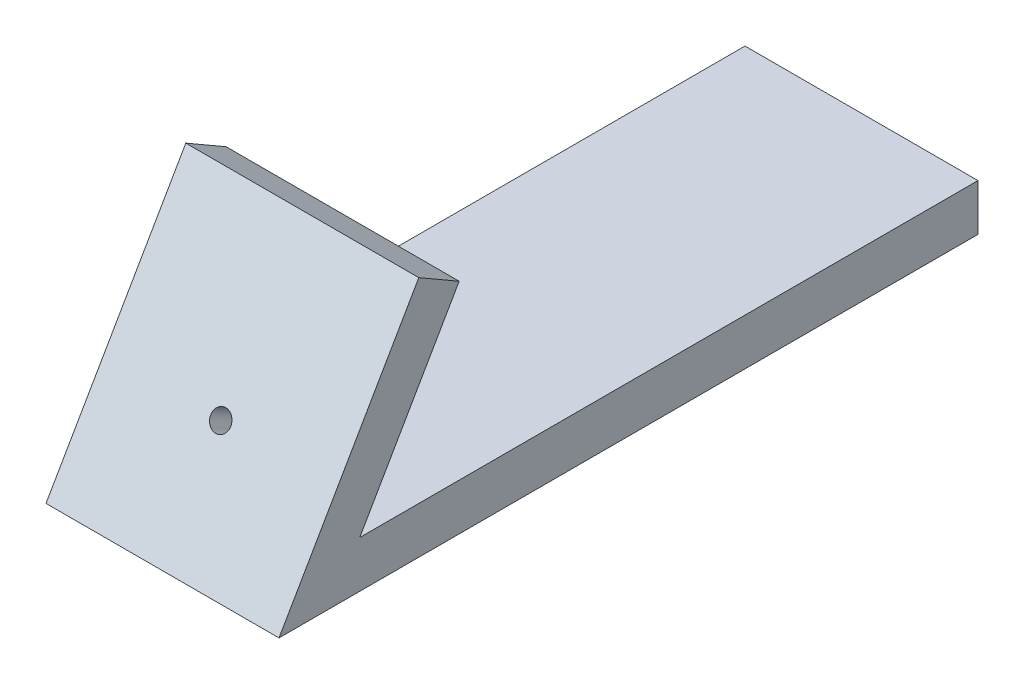
ISO-10303-21;
HEADER;
FILE_DESCRIPTION(('STEP AP214'),'2;1');
FILE_NAME('part.step','',(''),(''),'','','');
FILE_SCHEMA(('AUTOMOTIVE_DESIGN { 1 0 10303 214 1 1 1 1 }'));
ENDSEC;
DATA;
#1=APPLICATION_CONTEXT('core data for automotive mechanical design processes');
#2=APPLICATION_PROTOCOL_DEFINITION('international standard','automotive_design',2000,#1);
#3=PRODUCT_CONTEXT('',#1,'mechanical');
#4=PRODUCT('Part','Part','',(#3));
#5=PRODUCT_RELATED_PRODUCT_CATEGORY('part','',(#4));
#6=PRODUCT_DEFINITION_FORMATION('','',#4);
#7=PRODUCT_DEFINITION_CONTEXT('part definition',#1,'design');
#8=PRODUCT_DEFINITION('design','',#6,#7);
#9=PRODUCT_DEFINITION_SHAPE('','',#8);
#10=(LENGTH_UNIT() NAMED_UNIT(*) SI_UNIT(.MILLI.,.METRE.));
#11=(NAMED_UNIT(*) PLANE_ANGLE_UNIT() SI_UNIT($,.RADIAN.));
#12=(NAMED_UNIT(*) SI_UNIT($,.STERADIAN.) SOLID_ANGLE_UNIT());
#13=UNCERTAINTY_MEASURE_WITH_UNIT(LENGTH_MEASURE(1.E-05),#10,'distance_accuracy_value','');
#14=(GEOMETRIC_REPRESENTATION_CONTEXT(3) GLOBAL_UNCERTAINTY_ASSIGNED_CONTEXT((#13)) GLOBAL_UNIT_ASSIGNED_CONTEXT((#10,
#11,#12)) REPRESENTATION_CONTEXT('',''));
#15=CARTESIAN_POINT('',(0.,0.,0.));
#16=DIRECTION('',(0.,0.,1.));
#17=DIRECTION('',(1.,0.,0.));
#18=AXIS2_PLACEMENT_3D('',#15,#16,#17);
#19=CARTESIAN_POINT('',(50.,-1.952846430748,14.9831676560337));
#20=DIRECTION('',(0.,-1.,0.));
#21=DIRECTION('',(0.,0.,-1.));
#22=AXIS2_PLACEMENT_3D('',#19,#20,#21);
#23=PLANE('',#22);
#24=DIRECTION('',(0.,0.,1.));
#25=VECTOR('',#24,1.);
#26=CARTESIAN_POINT('',(0.,-1.952846430748,14.9831676560337));
#27=LINE('',#26,#25);
#28=CARTESIAN_POINT('',(0.,-1.952846430748,-117.696324268277));
#29=VERTEX_POINT('',#28);
#30=CARTESIAN_POINT('',(0.,-1.952846430748,14.9831676560337));
#31=VERTEX_POINT('',#30);
#32=EDGE_CURVE('E128',#29,#31,#27,.T.);
#33=ORIENTED_EDGE('',*,*,#32,.T.);
#34=DIRECTION('',(-1.,0.,0.));
#35=VECTOR('',#34,1.);
#36=CARTESIAN_POINT('',(50.,-1.952846430748,14.9831676560337));
#37=LINE('',#36,#35);
#38=CARTESIAN_POINT('',(50.,-1.952846430748,14.9831676560337));
#39=VERTEX_POINT('',#38);
#40=EDGE_CURVE('E11',#39,#31,#37,.T.);
#41=ORIENTED_EDGE('',*,*,#40,.F.);
#42=DIRECTION('',(0.,0.,1.));
#43=VECTOR('',#42,1.);
#44=CARTESIAN_POINT('',(50.,-1.952846430748,14.9831676560337));
#45=LINE('',#44,#43);
#46=CARTESIAN_POINT('',(50.,-1.952846430748,-117.696324268277));
#47=VERTEX_POINT('',#46);
#48=EDGE_CURVE('E145',#47,#39,#45,.T.);
#49=ORIENTED_EDGE('',*,*,#48,.F.);
#50=DIRECTION('',(-1.,0.,0.));
#51=VECTOR('',#50,1.);
#52=CARTESIAN_POINT('',(50.,-1.952846430748,-117.696324268277));
#53=LINE('',#52,#51);
#54=EDGE_CURVE('E124',#47,#29,#53,.T.);
#55=ORIENTED_EDGE('',*,*,#54,.T.);
#56=EDGE_LOOP('',(#33,#41,#49,#55));
#57=FACE_BOUND('',#56,.T.);
#58=ADVANCED_FACE('F39',(#57),#23,.F.);
#59=CARTESIAN_POINT('',(50.,35.0086777963181,-6.356578306122));
#60=DIRECTION('',(0.,0.500000000000004,0.866025403784436));
#61=DIRECTION('',(0.,-0.866025403784436,0.500000000000004));
#62=AXIS2_PLACEMENT_3D('',#59,#60,#61);
#63=PLANE('',#62);
#64=CARTESIAN_POINT('',(25.,4.69778866386285,11.1434216938781));
#65=DIRECTION('',(0.,0.500000000000004,0.866025403784436));
#66=DIRECTION('',(0.,-0.866025403784436,0.500000000000004));
#67=AXIS2_PLACEMENT_3D('',#64,#65,#66);
#68=CIRCLE('',#67,2.15);
#69=CARTESIAN_POINT('',(25.,2.83583404572632,12.2184216938782));
#70=VERTEX_POINT('',#69);
#71=EDGE_CURVE('E133',#70,#70,#68,.T.);
#72=ORIENTED_EDGE('',*,*,#71,.T.);
#73=EDGE_LOOP('',(#72));
#74=FACE_BOUND('',#73,.T.);
#75=DIRECTION('',(0.,0.866025403784436,-0.500000000000004));
#76=VECTOR('',#75,1.);
#77=CARTESIAN_POINT('',(0.,35.0086777963181,-6.356578306122));
#78=LINE('',#77,#76);
#79=CARTESIAN_POINT('',(0.,35.0086777963181,-6.356578306122));
#80=VERTEX_POINT('',#79);
#81=EDGE_CURVE('E132',#31,#80,#78,.T.);
#82=ORIENTED_EDGE('',*,*,#81,.T.);
#83=DIRECTION('',(-1.,0.,0.));
#84=VECTOR('',#83,1.);
#85=CARTESIAN_POINT('',(50.,35.0086777963181,-6.356578306122));
#86=LINE('',#85,#84);
#87=CARTESIAN_POINT('',(50.,35.0086777963181,-6.356578306122));
#88=VERTEX_POINT('',#87);
#89=EDGE_CURVE('E48',#88,#80,#86,.T.);
#90=ORIENTED_EDGE('',*,*,#89,.F.);
#91=DIRECTION('',(0.,0.866025403784436,-0.500000000000004));
#92=VECTOR('',#91,1.);
#93=CARTESIAN_POINT('',(50.,35.0086777963181,-6.356578306122));
#94=LINE('',#93,#92);
#95=EDGE_CURVE('E93',#39,#88,#94,.T.);
#96=ORIENTED_EDGE('',*,*,#95,.F.);
#97=ORIENTED_EDGE('',*,*,#40,.T.);
#98=EDGE_LOOP('',(#82,#90,#96,#97));
#99=FACE_BOUND('',#98,.T.);
#100=ADVANCED_FACE('F173',(#74,#99),#63,.F.);
#101=CARTESIAN_POINT('',(50.,40.0086777963182,2.30367573172237));
#102=DIRECTION('',(0.,-0.866025403784437,0.500000000000003));
#103=DIRECTION('',(0.,-0.500000000000003,-0.866025403784437));
#104=AXIS2_PLACEMENT_3D('',#101,#102,#103);
#105=PLANE('',#104);
#106=DIRECTION('',(0.,0.500000000000003,0.866025403784437));
#107=VECTOR('',#106,1.);
#108=CARTESIAN_POINT('',(0.,40.0086777963182,2.30367573172237));
#109=LINE('',#108,#107);
#110=CARTESIAN_POINT('',(0.,40.0086777963182,2.30367573172237));
#111=VERTEX_POINT('',#110);
#112=EDGE_CURVE('E136',#80,#111,#109,.T.);
#113=ORIENTED_EDGE('',*,*,#112,.T.);
#114=DIRECTION('',(-1.,0.,0.));
#115=VECTOR('',#114,1.);
#116=CARTESIAN_POINT('',(50.,40.0086777963182,2.30367573172237));
#117=LINE('',#116,#115);
#118=CARTESIAN_POINT('',(50.,40.0086777963182,2.30367573172237));
#119=VERTEX_POINT('',#118);
#120=EDGE_CURVE('E117',#119,#111,#117,.T.);
#121=ORIENTED_EDGE('',*,*,#120,.F.);
#122=DIRECTION('',(0.,0.500000000000003,0.866025403784437));
#123=VECTOR('',#122,1.);
#124=CARTESIAN_POINT('',(50.,40.0086777963182,2.30367573172237));
#125=LINE('',#124,#123);
#126=EDGE_CURVE('E106',#88,#119,#125,.T.);
#127=ORIENTED_EDGE('',*,*,#126,.F.);
#128=ORIENTED_EDGE('',*,*,#89,.T.);
#129=EDGE_LOOP('',(#113,#121,#127,#128));
#130=FACE_BOUND('',#129,.T.);
#131=ADVANCED_FACE('F155',(#130),#105,.F.);
#132=CARTESIAN_POINT('',(50.,-11.952846430748,32.3036757317226));
#133=DIRECTION('',(0.,-0.500000000000004,-0.866025403784437));
#134=DIRECTION('',(0.,0.866025403784437,-0.500000000000004));
#135=AXIS2_PLACEMENT_3D('',#132,#133,#134);
#136=PLANE('',#135);
#137=CARTESIAN_POINT('',(25.,9.69778866386289,19.8036757317225));
#138=DIRECTION('',(0.,0.500000000000004,0.866025403784437));
#139=DIRECTION('',(0.,-0.866025403784436,0.500000000000004));
#140=AXIS2_PLACEMENT_3D('',#137,#138,#139);
#141=CIRCLE('',#140,2.15);
#142=CARTESIAN_POINT('',(25.,7.83583404572635,20.8786757317225));
#143=VERTEX_POINT('',#142);
#144=EDGE_CURVE('E190',#143,#143,#141,.T.);
#145=ORIENTED_EDGE('',*,*,#144,.F.);
#146=EDGE_LOOP('',(#145));
#147=FACE_BOUND('',#146,.T.);
#148=DIRECTION('',(0.,-0.866025403784436,0.500000000000004));
#149=VECTOR('',#148,1.);
#150=CARTESIAN_POINT('',(0.,-11.952846430748,32.3036757317226));
#151=LINE('',#150,#149);
#152=CARTESIAN_POINT('',(0.,-11.952846430748,32.3036757317226));
#153=VERTEX_POINT('',#152);
#154=EDGE_CURVE('E115',#111,#153,#151,.T.);
#155=ORIENTED_EDGE('',*,*,#154,.T.);
#156=DIRECTION('',(-1.,0.,0.));
#157=VECTOR('',#156,1.);
#158=CARTESIAN_POINT('',(50.,-11.952846430748,32.3036757317226));
#159=LINE('',#158,#157);
#160=CARTESIAN_POINT('',(50.,-11.952846430748,32.3036757317226));
#161=VERTEX_POINT('',#160);
#162=EDGE_CURVE('E112',#161,#153,#159,.T.);
#163=ORIENTED_EDGE('',*,*,#162,.F.);
#164=DIRECTION('',(0.,-0.866025403784436,0.500000000000004));
#165=VECTOR('',#164,1.);
#166=CARTESIAN_POINT('',(50.,-11.952846430748,32.3036757317226));
#167=LINE('',#166,#165);
#168=EDGE_CURVE('E100',#119,#161,#167,.T.);
#169=ORIENTED_EDGE('',*,*,#168,.F.);
#170=ORIENTED_EDGE('',*,*,#120,.T.);
#171=EDGE_LOOP('',(#155,#163,#169,#170));
#172=FACE_BOUND('',#171,.T.);
#173=ADVANCED_FACE('F113',(#147,#172),#136,.F.);
#174=CARTESIAN_POINT('',(50.,-11.952846430748,-117.696324268277));
#175=DIRECTION('',(0.,1.,0.));
#176=DIRECTION('',(0.,0.,1.));
#177=AXIS2_PLACEMENT_3D('',#174,#175,#176);
#178=PLANE('',#177);
#179=DIRECTION('',(0.,0.,-1.));
#180=VECTOR('',#179,1.);
#181=CARTESIAN_POINT('',(0.,-11.952846430748,-117.696324268277));
#182=LINE('',#181,#180);
#183=CARTESIAN_POINT('',(0.,-11.952846430748,-117.696324268277));
#184=VERTEX_POINT('',#183);
#185=EDGE_CURVE('E79',#153,#184,#182,.T.);
#186=ORIENTED_EDGE('',*,*,#185,.T.);
#187=DIRECTION('',(-1.,0.,0.));
#188=VECTOR('',#187,1.);
#189=CARTESIAN_POINT('',(50.,-11.952846430748,-117.696324268277));
#190=LINE('',#189,#188);
#191=CARTESIAN_POINT('',(50.,-11.952846430748,-117.696324268277));
#192=VERTEX_POINT('',#191);
#193=EDGE_CURVE('E118',#192,#184,#190,.T.);
#194=ORIENTED_EDGE('',*,*,#193,.F.);
#195=DIRECTION('',(0.,0.,-1.));
#196=VECTOR('',#195,1.);
#197=CARTESIAN_POINT('',(50.,-11.952846430748,-117.696324268277));
#198=LINE('',#197,#196);
#199=EDGE_CURVE('E104',#161,#192,#198,.T.);
#200=ORIENTED_EDGE('',*,*,#199,.F.);
#201=ORIENTED_EDGE('',*,*,#162,.T.);
#202=EDGE_LOOP('',(#186,#194,#200,#201));
#203=FACE_BOUND('',#202,.T.);
#204=ADVANCED_FACE('F120',(#203),#178,.F.);
#205=CARTESIAN_POINT('',(50.,-1.952846430748,-117.696324268277));
#206=DIRECTION('',(0.,0.,1.));
#207=DIRECTION('',(1.,0.,0.));
#208=AXIS2_PLACEMENT_3D('',#205,#206,#207);
#209=PLANE('',#208);
#210=DIRECTION('',(0.,1.,0.));
#211=VECTOR('',#210,1.);
#212=CARTESIAN_POINT('',(0.,-1.952846430748,-117.696324268277));
#213=LINE('',#212,#211);
#214=EDGE_CURVE('E85',#184,#29,#213,.T.);
#215=ORIENTED_EDGE('',*,*,#214,.T.);
#216=ORIENTED_EDGE('',*,*,#54,.F.);
#217=DIRECTION('',(0.,1.,0.));
#218=VECTOR('',#217,1.);
#219=CARTESIAN_POINT('',(50.,-1.952846430748,-117.696324268277));
#220=LINE('',#219,#218);
#221=EDGE_CURVE('E56',#192,#47,#220,.T.);
#222=ORIENTED_EDGE('',*,*,#221,.F.);
#223=ORIENTED_EDGE('',*,*,#193,.T.);
#224=EDGE_LOOP('',(#215,#216,#222,#223));
#225=FACE_BOUND('',#224,.T.);
#226=ADVANCED_FACE('F162',(#225),#209,.F.);
#227=CARTESIAN_POINT('',(50.,0.,0.));
#228=DIRECTION('',(-1.,0.,0.));
#229=DIRECTION('',(0.,0.,1.));
#230=AXIS2_PLACEMENT_3D('',#227,#228,#229);
#231=PLANE('',#230);
#232=ORIENTED_EDGE('',*,*,#48,.T.);
#233=ORIENTED_EDGE('',*,*,#95,.T.);
#234=ORIENTED_EDGE('',*,*,#126,.T.);
#235=ORIENTED_EDGE('',*,*,#168,.T.);
#236=ORIENTED_EDGE('',*,*,#199,.T.);
#237=ORIENTED_EDGE('',*,*,#221,.T.);
#238=EDGE_LOOP('',(#232,#233,#234,#235,#236,#237));
#239=FACE_BOUND('',#238,.T.);
#240=ADVANCED_FACE('F102',(#239),#231,.F.);
#241=CARTESIAN_POINT('',(0.,0.,0.));
#242=DIRECTION('',(-1.,0.,0.));
#243=DIRECTION('',(0.,0.,1.));
#244=AXIS2_PLACEMENT_3D('',#241,#242,#243);
#245=PLANE('',#244);
#246=ORIENTED_EDGE('',*,*,#32,.F.);
#247=ORIENTED_EDGE('',*,*,#214,.F.);
#248=ORIENTED_EDGE('',*,*,#185,.F.);
#249=ORIENTED_EDGE('',*,*,#154,.F.);
#250=ORIENTED_EDGE('',*,*,#112,.F.);
#251=ORIENTED_EDGE('',*,*,#81,.F.);
#252=EDGE_LOOP('',(#246,#247,#248,#249,#250,#251));
#253=FACE_BOUND('',#252,.T.);
#254=ADVANCED_FACE('F158',(#253),#245,.T.);
#255=CARTESIAN_POINT('',(25.,0.697788663862817,4.21521846360264));
#256=DIRECTION('',(0.,0.500000000000004,0.866025403784436));
#257=DIRECTION('',(0.,-0.866025403784436,0.500000000000004));
#258=AXIS2_PLACEMENT_3D('',#255,#256,#257);
#259=CYLINDRICAL_SURFACE('',#258,2.15);
#260=ORIENTED_EDGE('',*,*,#144,.T.);
#261=EDGE_LOOP('',(#260));
#262=FACE_BOUND('',#261,.T.);
#263=ORIENTED_EDGE('',*,*,#71,.F.);
#264=EDGE_LOOP('',(#263));
#265=FACE_BOUND('',#264,.T.);
#266=ADVANCED_FACE('F203',(#262,#265),#259,.F.);
#267=CLOSED_SHELL('',(#58,#100,#131,#173,#204,#226,#240,#254,#266));
#268=MANIFOLD_SOLID_BREP('B2',#267);
#269=ADVANCED_BREP_SHAPE_REPRESENTATION('',(#18,#268),#14);
#270=SHAPE_DEFINITION_REPRESENTATION(#9,#269);
ENDSEC;
END-ISO-10303-21;
